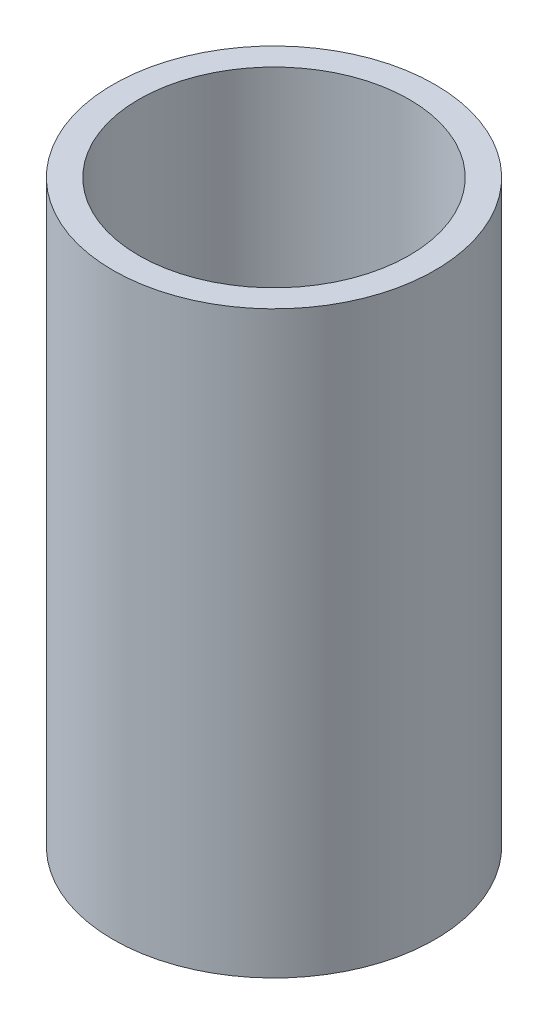
ISO-10303-21;
HEADER;
FILE_DESCRIPTION(('STEP AP214'),'2;1');
FILE_NAME('part.step','',(''),(''),'','','');
FILE_SCHEMA(('AUTOMOTIVE_DESIGN { 1 0 10303 214 1 1 1 1 }'));
ENDSEC;
DATA;
#1=APPLICATION_CONTEXT('core data for automotive mechanical design processes');
#2=APPLICATION_PROTOCOL_DEFINITION('international standard','automotive_design',2000,#1);
#3=PRODUCT_CONTEXT('',#1,'mechanical');
#4=PRODUCT('Part','Part','',(#3));
#5=PRODUCT_RELATED_PRODUCT_CATEGORY('part','',(#4));
#6=PRODUCT_DEFINITION_FORMATION('','',#4);
#7=PRODUCT_DEFINITION_CONTEXT('part definition',#1,'design');
#8=PRODUCT_DEFINITION('design','',#6,#7);
#9=PRODUCT_DEFINITION_SHAPE('','',#8);
#10=(LENGTH_UNIT() NAMED_UNIT(*) SI_UNIT(.MILLI.,.METRE.));
#11=(NAMED_UNIT(*) PLANE_ANGLE_UNIT() SI_UNIT($,.RADIAN.));
#12=(NAMED_UNIT(*) SI_UNIT($,.STERADIAN.) SOLID_ANGLE_UNIT());
#13=UNCERTAINTY_MEASURE_WITH_UNIT(LENGTH_MEASURE(1.E-05),#10,'distance_accuracy_value','');
#14=(GEOMETRIC_REPRESENTATION_CONTEXT(3) GLOBAL_UNCERTAINTY_ASSIGNED_CONTEXT((#13)) GLOBAL_UNIT_ASSIGNED_CONTEXT((#10,
#11,#12)) REPRESENTATION_CONTEXT('',''));
#15=CARTESIAN_POINT('',(0.,0.,0.));
#16=DIRECTION('',(0.,0.,1.));
#17=DIRECTION('',(1.,0.,0.));
#18=AXIS2_PLACEMENT_3D('',#15,#16,#17);
#19=CARTESIAN_POINT('',(0.,18.,0.));
#20=DIRECTION('',(0.,1.,0.));
#21=DIRECTION('',(0.,0.,1.));
#22=AXIS2_PLACEMENT_3D('',#19,#20,#21);
#23=PLANE('',#22);
#24=CARTESIAN_POINT('',(0.,18.,0.));
#25=DIRECTION('',(0.,1.,0.));
#26=DIRECTION('',(0.,0.,1.));
#27=AXIS2_PLACEMENT_3D('',#24,#25,#26);
#28=CIRCLE('',#27,5.);
#29=CARTESIAN_POINT('',(0.,18.,5.));
#30=VERTEX_POINT('',#29);
#31=EDGE_CURVE('E10',#30,#30,#28,.T.);
#32=ORIENTED_EDGE('',*,*,#31,.T.);
#33=EDGE_LOOP('',(#32));
#34=FACE_BOUND('',#33,.T.);
#35=CARTESIAN_POINT('',(0.,18.,0.));
#36=DIRECTION('',(0.,1.,0.));
#37=DIRECTION('',(0.,0.,1.));
#38=AXIS2_PLACEMENT_3D('',#35,#36,#37);
#39=CIRCLE('',#38,4.2);
#40=CARTESIAN_POINT('',(0.,18.,4.2));
#41=VERTEX_POINT('',#40);
#42=EDGE_CURVE('E46',#41,#41,#39,.T.);
#43=ORIENTED_EDGE('',*,*,#42,.F.);
#44=EDGE_LOOP('',(#43));
#45=FACE_BOUND('',#44,.T.);
#46=ADVANCED_FACE('F35',(#34,#45),#23,.T.);
#47=CARTESIAN_POINT('',(0.,0.,0.));
#48=DIRECTION('',(0.,1.,0.));
#49=DIRECTION('',(0.,0.,1.));
#50=AXIS2_PLACEMENT_3D('',#47,#48,#49);
#51=PLANE('',#50);
#52=CARTESIAN_POINT('',(0.,0.,0.));
#53=DIRECTION('',(0.,1.,0.));
#54=DIRECTION('',(0.,0.,1.));
#55=AXIS2_PLACEMENT_3D('',#52,#53,#54);
#56=CIRCLE('',#55,5.);
#57=CARTESIAN_POINT('',(0.,0.,5.));
#58=VERTEX_POINT('',#57);
#59=EDGE_CURVE('E39',#58,#58,#56,.T.);
#60=ORIENTED_EDGE('',*,*,#59,.F.);
#61=EDGE_LOOP('',(#60));
#62=FACE_BOUND('',#61,.T.);
#63=CARTESIAN_POINT('',(0.,0.,0.));
#64=DIRECTION('',(0.,1.,0.));
#65=DIRECTION('',(0.,0.,1.));
#66=AXIS2_PLACEMENT_3D('',#63,#64,#65);
#67=CIRCLE('',#66,4.2);
#68=CARTESIAN_POINT('',(0.,0.,4.2));
#69=VERTEX_POINT('',#68);
#70=EDGE_CURVE('E48',#69,#69,#67,.T.);
#71=ORIENTED_EDGE('',*,*,#70,.T.);
#72=EDGE_LOOP('',(#71));
#73=FACE_BOUND('',#72,.T.);
#74=ADVANCED_FACE('F58',(#62,#73),#51,.F.);
#75=CARTESIAN_POINT('',(0.,18.,0.));
#76=DIRECTION('',(0.,-1.,0.));
#77=DIRECTION('',(0.,0.,-1.));
#78=AXIS2_PLACEMENT_3D('',#75,#76,#77);
#79=CYLINDRICAL_SURFACE('',#78,5.);
#80=ORIENTED_EDGE('',*,*,#31,.F.);
#81=EDGE_LOOP('',(#80));
#82=FACE_BOUND('',#81,.T.);
#83=ORIENTED_EDGE('',*,*,#59,.T.);
#84=EDGE_LOOP('',(#83));
#85=FACE_BOUND('',#84,.T.);
#86=ADVANCED_FACE('F37',(#82,#85),#79,.T.);
#87=CARTESIAN_POINT('',(0.,18.,0.));
#88=DIRECTION('',(0.,-1.,0.));
#89=DIRECTION('',(0.,0.,-1.));
#90=AXIS2_PLACEMENT_3D('',#87,#88,#89);
#91=CYLINDRICAL_SURFACE('',#90,4.2);
#92=ORIENTED_EDGE('',*,*,#42,.T.);
#93=EDGE_LOOP('',(#92));
#94=FACE_BOUND('',#93,.T.);
#95=ORIENTED_EDGE('',*,*,#70,.F.);
#96=EDGE_LOOP('',(#95));
#97=FACE_BOUND('',#96,.T.);
#98=ADVANCED_FACE('F54',(#94,#97),#91,.F.);
#99=CLOSED_SHELL('',(#46,#74,#86,#98));
#100=MANIFOLD_SOLID_BREP('B2',#99);
#101=ADVANCED_BREP_SHAPE_REPRESENTATION('',(#18,#100),#14);
#102=SHAPE_DEFINITION_REPRESENTATION(#9,#101);
ENDSEC;
END-ISO-10303-21;
